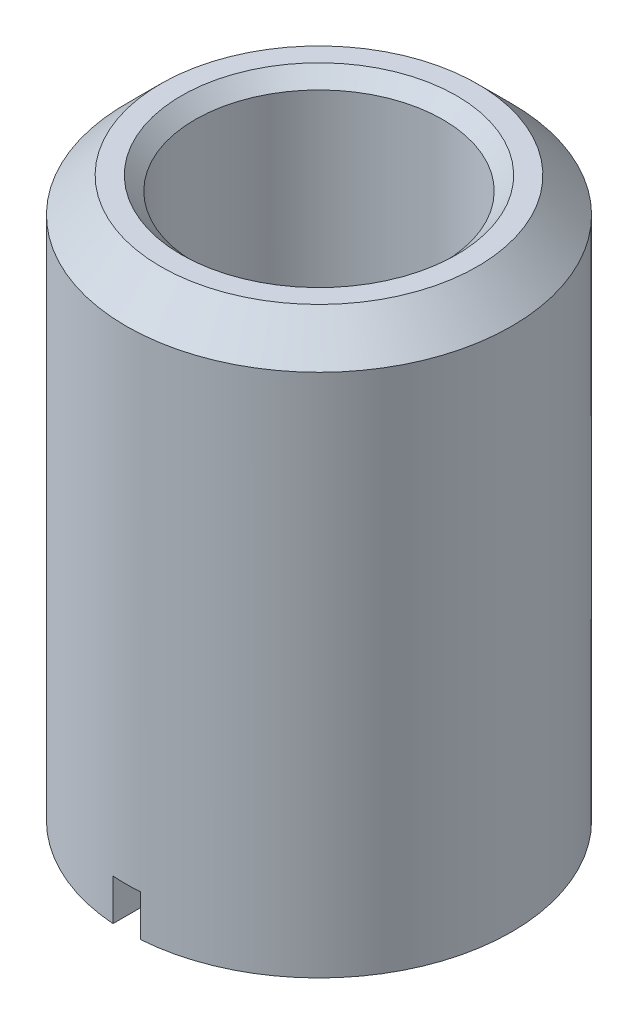
ISO-10303-21;
HEADER;
FILE_DESCRIPTION(('STEP AP214'),'2;1');
FILE_NAME('part.step','',(''),(''),'','','');
FILE_SCHEMA(('AUTOMOTIVE_DESIGN { 1 0 10303 214 1 1 1 1 }'));
ENDSEC;
DATA;
#1=APPLICATION_CONTEXT('core data for automotive mechanical design processes');
#2=APPLICATION_PROTOCOL_DEFINITION('international standard','automotive_design',2000,#1);
#3=PRODUCT_CONTEXT('',#1,'mechanical');
#4=PRODUCT('Part','Part','',(#3));
#5=PRODUCT_RELATED_PRODUCT_CATEGORY('part','',(#4));
#6=PRODUCT_DEFINITION_FORMATION('','',#4);
#7=PRODUCT_DEFINITION_CONTEXT('part definition',#1,'design');
#8=PRODUCT_DEFINITION('design','',#6,#7);
#9=PRODUCT_DEFINITION_SHAPE('','',#8);
#10=(LENGTH_UNIT() NAMED_UNIT(*) SI_UNIT(.MILLI.,.METRE.));
#11=(NAMED_UNIT(*) PLANE_ANGLE_UNIT() SI_UNIT($,.RADIAN.));
#12=(NAMED_UNIT(*) SI_UNIT($,.STERADIAN.) SOLID_ANGLE_UNIT());
#13=UNCERTAINTY_MEASURE_WITH_UNIT(LENGTH_MEASURE(1.E-05),#10,'distance_accuracy_value','');
#14=(GEOMETRIC_REPRESENTATION_CONTEXT(3) GLOBAL_UNCERTAINTY_ASSIGNED_CONTEXT((#13)) GLOBAL_UNIT_ASSIGNED_CONTEXT((#10,
#11,#12)) REPRESENTATION_CONTEXT('',''));
#15=CARTESIAN_POINT('',(0.,0.,0.));
#16=DIRECTION('',(0.,0.,1.));
#17=DIRECTION('',(1.,0.,0.));
#18=AXIS2_PLACEMENT_3D('',#15,#16,#17);
#19=CARTESIAN_POINT('',(0.,0.,0.));
#20=DIRECTION('',(0.,1.,0.));
#21=DIRECTION('',(0.,0.,1.));
#22=AXIS2_PLACEMENT_3D('',#19,#20,#21);
#23=PLANE('',#22);
#24=CARTESIAN_POINT('',(0.,0.,0.));
#25=DIRECTION('',(0.,1.,0.));
#26=DIRECTION('',(0.,0.,1.));
#27=AXIS2_PLACEMENT_3D('',#24,#25,#26);
#28=CIRCLE('',#27,5.);
#29=CARTESIAN_POINT('',(-0.500000000000001,0.,-4.9749371855331));
#30=VERTEX_POINT('',#29);
#31=CARTESIAN_POINT('',(-0.500000000000001,0.,4.9749371855331));
#32=VERTEX_POINT('',#31);
#33=EDGE_CURVE('E162',#30,#32,#28,.T.);
#34=ORIENTED_EDGE('',*,*,#33,.T.);
#35=DIRECTION('',(0.,0.,-1.));
#36=VECTOR('',#35,1.);
#37=CARTESIAN_POINT('',(-0.500000000000001,0.,4.47213595499958));
#38=LINE('',#37,#36);
#39=CARTESIAN_POINT('',(-0.500000000000001,0.,6.98212002188447));
#40=VERTEX_POINT('',#39);
#41=EDGE_CURVE('E110',#40,#32,#38,.T.);
#42=ORIENTED_EDGE('',*,*,#41,.F.);
#43=CARTESIAN_POINT('',(0.,0.,0.));
#44=DIRECTION('',(0.,1.,0.));
#45=DIRECTION('',(0.,0.,1.));
#46=AXIS2_PLACEMENT_3D('',#43,#44,#45);
#47=CIRCLE('',#46,7.);
#48=CARTESIAN_POINT('',(-0.500000000000001,0.,-6.98212002188447));
#49=VERTEX_POINT('',#48);
#50=EDGE_CURVE('E153',#49,#40,#47,.T.);
#51=ORIENTED_EDGE('',*,*,#50,.F.);
#52=DIRECTION('',(0.,0.,-1.));
#53=VECTOR('',#52,1.);
#54=CARTESIAN_POINT('',(-0.5,0.,-9.6402329151062));
#55=LINE('',#54,#53);
#56=EDGE_CURVE('E134',#30,#49,#55,.T.);
#57=ORIENTED_EDGE('',*,*,#56,.F.);
#58=EDGE_LOOP('',(#34,#42,#51,#57));
#59=FACE_BOUND('',#58,.T.);
#60=ADVANCED_FACE('F16',(#59),#23,.F.);
#61=CARTESIAN_POINT('',(0.,0.,0.));
#62=DIRECTION('',(0.,-1.,0.));
#63=DIRECTION('',(0.,0.,-1.));
#64=AXIS2_PLACEMENT_3D('',#61,#62,#63);
#65=CONICAL_SURFACE('',#64,5.,0.785398163397446);
#66=CARTESIAN_POINT('',(-0.500000000000001,-0.68848006517373,5.66646322249416));
#67=CARTESIAN_POINT('',(-0.500000000000001,-0.532725975536453,5.51010217788107));
#68=CARTESIAN_POINT('',(-0.500000000000001,-0.376995103312321,5.35371799426231));
#69=CARTESIAN_POINT('',(-0.500000000000001,-0.065598691519161,5.04088469963116));
#70=CARTESIAN_POINT('',(-0.500000000000001,0.0900668480713709,4.88443558864016));
#71=CARTESIAN_POINT('',(-0.500000000000001,0.401313826916442,4.57145365923052));
#72=CARTESIAN_POINT('',(-0.500000000000001,0.556895266156108,4.41492084079707));
#73=CARTESIAN_POINT('',(-0.500000000000001,0.867939304291719,4.10173708025875));
#74=CARTESIAN_POINT('',(-0.500000000000001,1.02340190314792,3.9450861381144));
#75=CARTESIAN_POINT('',(-0.500000000000002,1.17878767355104,3.78835896448653));
#76=B_SPLINE_CURVE_WITH_KNOTS('',3,(#66,#67,#68,#69,#70,#71,#72,#73,#74,#75),.UNSPECIFIED.,.F.,
.F.,(4,2,2,2,4),(0.,0.662097444366519,1.32419467063923,1.9862920139647,2.6483895786312),.UNSPECIFIED.);
#77=CARTESIAN_POINT('',(-0.500000000000001,0.5,4.47213595499958));
#78=VERTEX_POINT('',#77);
#79=EDGE_CURVE('E105',#32,#78,#76,.T.);
#80=ORIENTED_EDGE('',*,*,#79,.F.);
#81=ORIENTED_EDGE('',*,*,#33,.F.);
#82=CARTESIAN_POINT('',(-0.500000000000001,0.984928824074124,-3.98381683160143));
#83=CARTESIAN_POINT('',(-0.500000000000001,0.829479445681695,-4.14048087177881));
#84=CARTESIAN_POINT('',(-0.500000000000001,0.673963525561281,-4.2970788417414));
#85=CARTESIAN_POINT('',(-0.500000000000001,0.362827845086437,-4.61017151588065));
#86=CARTESIAN_POINT('',(-0.500000000000001,0.207208084759055,-4.76666622008419));
#87=CARTESIAN_POINT('',(-0.500000000000001,-0.104106093250768,-5.07958129815787));
#88=CARTESIAN_POINT('',(-0.500000000000001,-0.259800510923307,-5.23600167203785));
#89=CARTESIAN_POINT('',(-0.500000000000001,-0.57124782083203,-5.54878427692052));
#90=CARTESIAN_POINT('',(-0.500000000000001,-0.727000713083231,-5.70514650790824));
#91=CARTESIAN_POINT('',(-0.500000000000001,-0.88277470089878,-5.86148771060169));
#92=B_SPLINE_CURVE_WITH_KNOTS('',3,(#82,#83,#84,#85,#86,#87,#88,#89,#90,#91),.UNSPECIFIED.,.F.,
.F.,(4,2,2,2,4),(0.,0.662097493355755,1.32419481431399,1.98629204748077,2.64838945080524),.UNSPECIFIED.);
#93=CARTESIAN_POINT('',(-0.500000000000001,0.5,-4.47213595499958));
#94=VERTEX_POINT('',#93);
#95=EDGE_CURVE('E174',#94,#30,#92,.T.);
#96=ORIENTED_EDGE('',*,*,#95,.F.);
#97=CARTESIAN_POINT('',(0.,0.5,0.));
#98=DIRECTION('',(0.,1.,0.));
#99=DIRECTION('',(0.,0.,1.));
#100=AXIS2_PLACEMENT_3D('',#97,#98,#99);
#101=CIRCLE('',#100,4.5);
#102=EDGE_CURVE('E165',#78,#94,#101,.F.);
#103=ORIENTED_EDGE('',*,*,#102,.F.);
#104=EDGE_LOOP('',(#80,#81,#96,#103));
#105=FACE_BOUND('',#104,.T.);
#106=ADVANCED_FACE('F200',(#105),#65,.F.);
#107=CARTESIAN_POINT('',(0.,20.3,0.));
#108=DIRECTION('',(0.,1.,0.));
#109=DIRECTION('',(0.,0.,1.));
#110=AXIS2_PLACEMENT_3D('',#107,#108,#109);
#111=PLANE('',#110);
#112=CARTESIAN_POINT('',(0.,20.3,0.));
#113=DIRECTION('',(0.,1.,0.));
#114=DIRECTION('',(0.,0.,1.));
#115=AXIS2_PLACEMENT_3D('',#112,#113,#114);
#116=CIRCLE('',#115,5.75);
#117=CARTESIAN_POINT('',(0.,20.3,5.75));
#118=VERTEX_POINT('',#117);
#119=EDGE_CURVE('E24',#118,#118,#116,.T.);
#120=ORIENTED_EDGE('',*,*,#119,.T.);
#121=EDGE_LOOP('',(#120));
#122=FACE_BOUND('',#121,.T.);
#123=CARTESIAN_POINT('',(0.,20.3,0.));
#124=DIRECTION('',(0.,1.,0.));
#125=DIRECTION('',(0.,0.,1.));
#126=AXIS2_PLACEMENT_3D('',#123,#124,#125);
#127=CIRCLE('',#126,5.);
#128=CARTESIAN_POINT('',(0.,20.3,5.));
#129=VERTEX_POINT('',#128);
#130=EDGE_CURVE('E159',#129,#129,#127,.F.);
#131=ORIENTED_EDGE('',*,*,#130,.T.);
#132=EDGE_LOOP('',(#131));
#133=FACE_BOUND('',#132,.T.);
#134=ADVANCED_FACE('F196',(#122,#133),#111,.T.);
#135=CARTESIAN_POINT('',(0.500000000000001,0.,6.98212002188447));
#136=VERTEX_POINT('',#135);
#137=CARTESIAN_POINT('',(0.500000000000001,0.,-6.98212002188447));
#138=VERTEX_POINT('',#137);
#139=EDGE_CURVE('E152',#136,#138,#47,.T.);
#140=ORIENTED_EDGE('',*,*,#139,.F.);
#141=DIRECTION('',(0.,0.,1.));
#142=VECTOR('',#141,1.);
#143=CARTESIAN_POINT('',(0.500000000000001,0.,4.47213595499958));
#144=LINE('',#143,#142);
#145=CARTESIAN_POINT('',(0.500000000000001,0.,4.9749371855331));
#146=VERTEX_POINT('',#145);
#147=EDGE_CURVE('E264',#146,#136,#144,.T.);
#148=ORIENTED_EDGE('',*,*,#147,.F.);
#149=CARTESIAN_POINT('',(0.500000000000001,0.,-4.9749371855331));
#150=VERTEX_POINT('',#149);
#151=EDGE_CURVE('E39',#146,#150,#28,.T.);
#152=ORIENTED_EDGE('',*,*,#151,.T.);
#153=DIRECTION('',(0.,0.,1.));
#154=VECTOR('',#153,1.);
#155=CARTESIAN_POINT('',(0.5,0.,-9.6402329151062));
#156=LINE('',#155,#154);
#157=EDGE_CURVE('E130',#138,#150,#156,.T.);
#158=ORIENTED_EDGE('',*,*,#157,.F.);
#159=EDGE_LOOP('',(#140,#148,#152,#158));
#160=FACE_BOUND('',#159,.T.);
#161=ADVANCED_FACE('F199',(#160),#23,.F.);
#162=CARTESIAN_POINT('',(0.,20.3,0.));
#163=DIRECTION('',(0.,-1.,0.));
#164=DIRECTION('',(0.,0.,-1.));
#165=AXIS2_PLACEMENT_3D('',#162,#163,#164);
#166=CYLINDRICAL_SURFACE('',#165,7.);
#167=CARTESIAN_POINT('',(0.,19.05,0.));
#168=DIRECTION('',(0.,1.,0.));
#169=DIRECTION('',(0.,0.,1.));
#170=AXIS2_PLACEMENT_3D('',#167,#168,#169);
#171=CIRCLE('',#170,7.);
#172=CARTESIAN_POINT('',(0.,19.05,7.));
#173=VERTEX_POINT('',#172);
#174=EDGE_CURVE('E10',#173,#173,#171,.F.);
#175=ORIENTED_EDGE('',*,*,#174,.T.);
#176=EDGE_LOOP('',(#175));
#177=FACE_BOUND('',#176,.T.);
#178=ORIENTED_EDGE('',*,*,#50,.T.);
#179=DIRECTION('',(0.,-1.,0.));
#180=VECTOR('',#179,1.);
#181=CARTESIAN_POINT('',(-0.500000000000001,20.3,6.98212002188447));
#182=LINE('',#181,#180);
#183=CARTESIAN_POINT('',(-0.500000000000001,1.5,6.98212002188447));
#184=VERTEX_POINT('',#183);
#185=EDGE_CURVE('E125',#40,#184,#182,.F.);
#186=ORIENTED_EDGE('',*,*,#185,.T.);
#187=CARTESIAN_POINT('',(0.,1.5,0.));
#188=DIRECTION('',(0.,-1.,0.));
#189=DIRECTION('',(0.,0.,-1.));
#190=AXIS2_PLACEMENT_3D('',#187,#188,#189);
#191=CIRCLE('',#190,7.);
#192=CARTESIAN_POINT('',(0.500000000000001,1.5,6.98212002188447));
#193=VERTEX_POINT('',#192);
#194=EDGE_CURVE('E128',#193,#184,#191,.T.);
#195=ORIENTED_EDGE('',*,*,#194,.F.);
#196=DIRECTION('',(0.,-1.,0.));
#197=VECTOR('',#196,1.);
#198=CARTESIAN_POINT('',(0.500000000000001,20.3,6.98212002188447));
#199=LINE('',#198,#197);
#200=EDGE_CURVE('E109',#193,#136,#199,.T.);
#201=ORIENTED_EDGE('',*,*,#200,.T.);
#202=ORIENTED_EDGE('',*,*,#139,.T.);
#203=DIRECTION('',(0.,-1.,0.));
#204=VECTOR('',#203,1.);
#205=CARTESIAN_POINT('',(0.500000000000001,20.3,-6.98212002188447));
#206=LINE('',#205,#204);
#207=CARTESIAN_POINT('',(0.500000000000001,1.5,-6.98212002188447));
#208=VERTEX_POINT('',#207);
#209=EDGE_CURVE('E143',#138,#208,#206,.F.);
#210=ORIENTED_EDGE('',*,*,#209,.T.);
#211=CARTESIAN_POINT('',(0.,1.5,0.));
#212=DIRECTION('',(0.,-1.,0.));
#213=DIRECTION('',(0.,0.,-1.));
#214=AXIS2_PLACEMENT_3D('',#211,#212,#213);
#215=CIRCLE('',#214,7.);
#216=CARTESIAN_POINT('',(-0.500000000000001,1.5,-6.98212002188447));
#217=VERTEX_POINT('',#216);
#218=EDGE_CURVE('E150',#217,#208,#215,.T.);
#219=ORIENTED_EDGE('',*,*,#218,.F.);
#220=DIRECTION('',(0.,-1.,0.));
#221=VECTOR('',#220,1.);
#222=CARTESIAN_POINT('',(-0.500000000000001,20.3,-6.98212002188447));
#223=LINE('',#222,#221);
#224=EDGE_CURVE('E147',#217,#49,#223,.T.);
#225=ORIENTED_EDGE('',*,*,#224,.T.);
#226=EDGE_LOOP('',(#178,#186,#195,#201,#202,#210,#219,#225));
#227=FACE_BOUND('',#226,.T.);
#228=ADVANCED_FACE('F195',(#177,#227),#166,.T.);
#229=CARTESIAN_POINT('',(0.,20.3,0.));
#230=DIRECTION('',(0.,-1.,0.));
#231=DIRECTION('',(0.,0.,-1.));
#232=AXIS2_PLACEMENT_3D('',#229,#230,#231);
#233=CYLINDRICAL_SURFACE('',#232,4.5);
#234=DIRECTION('',(0.,-1.,0.));
#235=VECTOR('',#234,1.);
#236=CARTESIAN_POINT('',(-0.500000000000001,1.5,4.47213595499958));
#237=LINE('',#236,#235);
#238=CARTESIAN_POINT('',(-0.500000000000001,1.5,4.47213595499958));
#239=VERTEX_POINT('',#238);
#240=EDGE_CURVE('E118',#239,#78,#237,.T.);
#241=ORIENTED_EDGE('',*,*,#240,.T.);
#242=ORIENTED_EDGE('',*,*,#102,.T.);
#243=DIRECTION('',(0.,-1.,0.));
#244=VECTOR('',#243,1.);
#245=CARTESIAN_POINT('',(-0.500000000000001,1.5,-4.47213595499958));
#246=LINE('',#245,#244);
#247=CARTESIAN_POINT('',(-0.500000000000001,1.5,-4.47213595499958));
#248=VERTEX_POINT('',#247);
#249=EDGE_CURVE('E140',#248,#94,#246,.T.);
#250=ORIENTED_EDGE('',*,*,#249,.F.);
#251=CARTESIAN_POINT('',(0.,1.5,0.));
#252=DIRECTION('',(0.,-1.,0.));
#253=DIRECTION('',(0.,0.,-1.));
#254=AXIS2_PLACEMENT_3D('',#251,#252,#253);
#255=CIRCLE('',#254,4.5);
#256=CARTESIAN_POINT('',(0.500000000000001,1.5,-4.47213595499958));
#257=VERTEX_POINT('',#256);
#258=EDGE_CURVE('E232',#248,#257,#255,.T.);
#259=ORIENTED_EDGE('',*,*,#258,.T.);
#260=DIRECTION('',(0.,-1.,0.));
#261=VECTOR('',#260,1.);
#262=CARTESIAN_POINT('',(0.500000000000001,1.5,-4.47213595499958));
#263=LINE('',#262,#261);
#264=CARTESIAN_POINT('',(0.500000000000001,0.5,-4.47213595499958));
#265=VERTEX_POINT('',#264);
#266=EDGE_CURVE('E137',#257,#265,#263,.T.);
#267=ORIENTED_EDGE('',*,*,#266,.T.);
#268=CARTESIAN_POINT('',(0.500000000000001,0.5,4.47213595499958));
#269=VERTEX_POINT('',#268);
#270=EDGE_CURVE('E117',#265,#269,#101,.F.);
#271=ORIENTED_EDGE('',*,*,#270,.T.);
#272=DIRECTION('',(0.,-1.,0.));
#273=VECTOR('',#272,1.);
#274=CARTESIAN_POINT('',(0.500000000000001,1.5,4.47213595499958));
#275=LINE('',#274,#273);
#276=CARTESIAN_POINT('',(0.500000000000001,1.5,4.47213595499958));
#277=VERTEX_POINT('',#276);
#278=EDGE_CURVE('E31',#277,#269,#275,.T.);
#279=ORIENTED_EDGE('',*,*,#278,.F.);
#280=CARTESIAN_POINT('',(0.,1.5,0.));
#281=DIRECTION('',(0.,-1.,0.));
#282=DIRECTION('',(0.,0.,-1.));
#283=AXIS2_PLACEMENT_3D('',#280,#281,#282);
#284=CIRCLE('',#283,4.5);
#285=EDGE_CURVE('E96',#277,#239,#284,.T.);
#286=ORIENTED_EDGE('',*,*,#285,.T.);
#287=EDGE_LOOP('',(#241,#242,#250,#259,#267,#271,#279,#286));
#288=FACE_BOUND('',#287,.T.);
#289=CARTESIAN_POINT('',(0.,19.8,0.));
#290=DIRECTION('',(0.,1.,0.));
#291=DIRECTION('',(0.,0.,1.));
#292=AXIS2_PLACEMENT_3D('',#289,#290,#291);
#293=CIRCLE('',#292,4.5);
#294=CARTESIAN_POINT('',(0.,19.8,4.5));
#295=VERTEX_POINT('',#294);
#296=EDGE_CURVE('E156',#295,#295,#293,.T.);
#297=ORIENTED_EDGE('',*,*,#296,.T.);
#298=EDGE_LOOP('',(#297));
#299=FACE_BOUND('',#298,.T.);
#300=ADVANCED_FACE('F113',(#288,#299),#233,.F.);
#301=CARTESIAN_POINT('',(0.,19.8,0.));
#302=DIRECTION('',(0.,1.,0.));
#303=DIRECTION('',(0.,0.,1.));
#304=AXIS2_PLACEMENT_3D('',#301,#302,#303);
#305=CONICAL_SURFACE('',#304,4.5,0.785398163397453);
#306=ORIENTED_EDGE('',*,*,#130,.F.);
#307=EDGE_LOOP('',(#306));
#308=FACE_BOUND('',#307,.T.);
#309=ORIENTED_EDGE('',*,*,#296,.F.);
#310=EDGE_LOOP('',(#309));
#311=FACE_BOUND('',#310,.T.);
#312=ADVANCED_FACE('F194',(#308,#311),#305,.F.);
#313=CARTESIAN_POINT('',(0.500000000000002,1.17878767355104,3.78835896448653));
#314=CARTESIAN_POINT('',(0.500000000000001,1.02340190314792,3.9450861381144));
#315=CARTESIAN_POINT('',(0.500000000000001,0.867939304291719,4.10173708025875));
#316=CARTESIAN_POINT('',(0.500000000000001,0.556895266156108,4.41492084079707));
#317=CARTESIAN_POINT('',(0.500000000000001,0.401313826916441,4.57145365923052));
#318=CARTESIAN_POINT('',(0.500000000000001,0.0900668480713705,4.88443558864016));
#319=CARTESIAN_POINT('',(0.500000000000001,-0.0655986915191607,5.04088469963116));
#320=CARTESIAN_POINT('',(0.500000000000001,-0.37699510331232,5.35371799426231));
#321=CARTESIAN_POINT('',(0.500000000000001,-0.532725975536452,5.51010217788107));
#322=CARTESIAN_POINT('',(0.500000000000001,-0.68848006517373,5.66646322249416));
#323=B_SPLINE_CURVE_WITH_KNOTS('',3,(#313,#314,#315,#316,#317,#318,#319,#320,#321,#322),
.UNSPECIFIED.,.F.,.F.,(4,2,2,2,4),(0.,0.662097564666504,1.32419490799197,1.98629213426468,
2.6483895786312),.UNSPECIFIED.);
#324=EDGE_CURVE('E230',#269,#146,#323,.T.);
#325=ORIENTED_EDGE('',*,*,#324,.F.);
#326=ORIENTED_EDGE('',*,*,#270,.F.);
#327=CARTESIAN_POINT('',(0.500000000000001,-0.88277470089878,-5.86148771060169));
#328=CARTESIAN_POINT('',(0.500000000000001,-0.727000713083231,-5.70514650790824));
#329=CARTESIAN_POINT('',(0.500000000000001,-0.571247820832031,-5.54878427692052));
#330=CARTESIAN_POINT('',(0.500000000000001,-0.259800510923308,-5.23600167203785));
#331=CARTESIAN_POINT('',(0.500000000000001,-0.104106093250768,-5.07958129815787));
#332=CARTESIAN_POINT('',(0.500000000000001,0.207208084759055,-4.76666622008419));
#333=CARTESIAN_POINT('',(0.500000000000001,0.362827845086437,-4.61017151588065));
#334=CARTESIAN_POINT('',(0.500000000000001,0.673963525561281,-4.2970788417414));
#335=CARTESIAN_POINT('',(0.500000000000001,0.829479445681695,-4.14048087177881));
#336=CARTESIAN_POINT('',(0.500000000000001,0.984928824074124,-3.98381683160143));
#337=B_SPLINE_CURVE_WITH_KNOTS('',3,(#327,#328,#329,#330,#331,#332,#333,#334,#335,#336),
.UNSPECIFIED.,.F.,.F.,(4,2,2,2,4),(0.,0.662097403324474,1.32419463649125,1.98629195744949,
2.64838945080524),.UNSPECIFIED.);
#338=EDGE_CURVE('E167',#150,#265,#337,.T.);
#339=ORIENTED_EDGE('',*,*,#338,.F.);
#340=ORIENTED_EDGE('',*,*,#151,.F.);
#341=EDGE_LOOP('',(#325,#326,#339,#340));
#342=FACE_BOUND('',#341,.T.);
#343=ADVANCED_FACE('F181',(#342),#65,.F.);
#344=CARTESIAN_POINT('',(0.,1.5,0.));
#345=DIRECTION('',(0.,-1.,0.));
#346=DIRECTION('',(0.,0.,-1.));
#347=AXIS2_PLACEMENT_3D('',#344,#345,#346);
#348=PLANE('',#347);
#349=ORIENTED_EDGE('',*,*,#218,.T.);
#350=DIRECTION('',(0.,0.,1.));
#351=VECTOR('',#350,1.);
#352=CARTESIAN_POINT('',(0.5,1.5,-9.6402329151062));
#353=LINE('',#352,#351);
#354=EDGE_CURVE('E131',#208,#257,#353,.T.);
#355=ORIENTED_EDGE('',*,*,#354,.T.);
#356=ORIENTED_EDGE('',*,*,#258,.F.);
#357=DIRECTION('',(0.,0.,-1.));
#358=VECTOR('',#357,1.);
#359=CARTESIAN_POINT('',(-0.5,1.5,-9.6402329151062));
#360=LINE('',#359,#358);
#361=EDGE_CURVE('E133',#248,#217,#360,.T.);
#362=ORIENTED_EDGE('',*,*,#361,.T.);
#363=EDGE_LOOP('',(#349,#355,#356,#362));
#364=FACE_BOUND('',#363,.T.);
#365=ADVANCED_FACE('F212',(#364),#348,.T.);
#366=CARTESIAN_POINT('',(-0.5,1.5,-9.6402329151062));
#367=DIRECTION('',(-1.,0.,0.));
#368=DIRECTION('',(0.,0.,1.));
#369=AXIS2_PLACEMENT_3D('',#366,#367,#368);
#370=PLANE('',#369);
#371=ORIENTED_EDGE('',*,*,#361,.F.);
#372=ORIENTED_EDGE('',*,*,#249,.T.);
#373=ORIENTED_EDGE('',*,*,#95,.T.);
#374=ORIENTED_EDGE('',*,*,#56,.T.);
#375=ORIENTED_EDGE('',*,*,#224,.F.);
#376=EDGE_LOOP('',(#371,#372,#373,#374,#375));
#377=FACE_BOUND('',#376,.T.);
#378=ADVANCED_FACE('F188',(#377),#370,.F.);
#379=CARTESIAN_POINT('',(0.5,1.5,-9.6402329151062));
#380=DIRECTION('',(1.,0.,0.));
#381=DIRECTION('',(0.,0.,-1.));
#382=AXIS2_PLACEMENT_3D('',#379,#380,#381);
#383=PLANE('',#382);
#384=ORIENTED_EDGE('',*,*,#157,.T.);
#385=ORIENTED_EDGE('',*,*,#338,.T.);
#386=ORIENTED_EDGE('',*,*,#266,.F.);
#387=ORIENTED_EDGE('',*,*,#354,.F.);
#388=ORIENTED_EDGE('',*,*,#209,.F.);
#389=EDGE_LOOP('',(#384,#385,#386,#387,#388));
#390=FACE_BOUND('',#389,.T.);
#391=ADVANCED_FACE('F184',(#390),#383,.F.);
#392=CARTESIAN_POINT('',(0.,1.5,0.));
#393=DIRECTION('',(0.,-1.,0.));
#394=DIRECTION('',(0.,0.,-1.));
#395=AXIS2_PLACEMENT_3D('',#392,#393,#394);
#396=PLANE('',#395);
#397=ORIENTED_EDGE('',*,*,#194,.T.);
#398=DIRECTION('',(0.,0.,-1.));
#399=VECTOR('',#398,1.);
#400=CARTESIAN_POINT('',(-0.500000000000001,1.5,4.47213595499958));
#401=LINE('',#400,#399);
#402=EDGE_CURVE('E101',#184,#239,#401,.T.);
#403=ORIENTED_EDGE('',*,*,#402,.T.);
#404=ORIENTED_EDGE('',*,*,#285,.F.);
#405=DIRECTION('',(0.,0.,1.));
#406=VECTOR('',#405,1.);
#407=CARTESIAN_POINT('',(0.500000000000001,1.5,4.47213595499958));
#408=LINE('',#407,#406);
#409=EDGE_CURVE('E98',#277,#193,#408,.T.);
#410=ORIENTED_EDGE('',*,*,#409,.T.);
#411=EDGE_LOOP('',(#397,#403,#404,#410));
#412=FACE_BOUND('',#411,.T.);
#413=ADVANCED_FACE('F97',(#412),#396,.T.);
#414=CARTESIAN_POINT('',(-0.500000000000001,1.5,4.47213595499958));
#415=DIRECTION('',(-1.,0.,0.));
#416=DIRECTION('',(0.,0.,1.));
#417=AXIS2_PLACEMENT_3D('',#414,#415,#416);
#418=PLANE('',#417);
#419=ORIENTED_EDGE('',*,*,#41,.T.);
#420=ORIENTED_EDGE('',*,*,#79,.T.);
#421=ORIENTED_EDGE('',*,*,#240,.F.);
#422=ORIENTED_EDGE('',*,*,#402,.F.);
#423=ORIENTED_EDGE('',*,*,#185,.F.);
#424=EDGE_LOOP('',(#419,#420,#421,#422,#423));
#425=FACE_BOUND('',#424,.T.);
#426=ADVANCED_FACE('F244',(#425),#418,.F.);
#427=CARTESIAN_POINT('',(0.500000000000001,1.5,4.47213595499958));
#428=DIRECTION('',(1.,0.,0.));
#429=DIRECTION('',(0.,0.,-1.));
#430=AXIS2_PLACEMENT_3D('',#427,#428,#429);
#431=PLANE('',#430);
#432=ORIENTED_EDGE('',*,*,#409,.F.);
#433=ORIENTED_EDGE('',*,*,#278,.T.);
#434=ORIENTED_EDGE('',*,*,#324,.T.);
#435=ORIENTED_EDGE('',*,*,#147,.T.);
#436=ORIENTED_EDGE('',*,*,#200,.F.);
#437=EDGE_LOOP('',(#432,#433,#434,#435,#436));
#438=FACE_BOUND('',#437,.T.);
#439=ADVANCED_FACE('F107',(#438),#431,.F.);
#440=CARTESIAN_POINT('',(0.,20.3,0.));
#441=DIRECTION('',(0.,-1.,0.));
#442=DIRECTION('',(0.,0.,-1.));
#443=AXIS2_PLACEMENT_3D('',#440,#441,#442);
#444=CONICAL_SURFACE('',#443,5.75,0.785398163397447);
#445=ORIENTED_EDGE('',*,*,#174,.F.);
#446=EDGE_LOOP('',(#445));
#447=FACE_BOUND('',#446,.T.);
#448=ORIENTED_EDGE('',*,*,#119,.F.);
#449=EDGE_LOOP('',(#448));
#450=FACE_BOUND('',#449,.T.);
#451=ADVANCED_FACE('F18',(#447,#450),#444,.T.);
#452=CLOSED_SHELL('',(#60,#106,#134,#161,#228,#300,#312,#343,#365,#378,#391,#413,#426,#439,#451));
#453=MANIFOLD_SOLID_BREP('B1',#452);
#454=ADVANCED_BREP_SHAPE_REPRESENTATION('',(#18,#453),#14);
#455=SHAPE_DEFINITION_REPRESENTATION(#9,#454);
ENDSEC;
END-ISO-10303-21;
